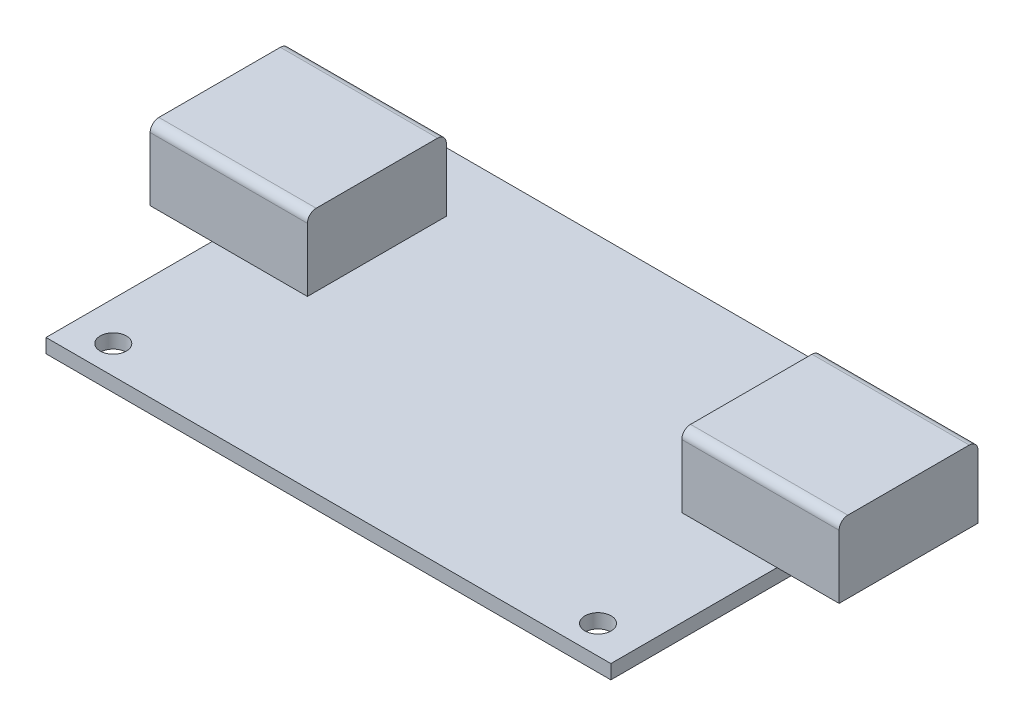
ISO-10303-21;
HEADER;
FILE_DESCRIPTION(('STEP AP214'),'2;1');
FILE_NAME('part.step','',(''),(''),'','','');
FILE_SCHEMA(('AUTOMOTIVE_DESIGN { 1 0 10303 214 1 1 1 1 }'));
ENDSEC;
DATA;
#1=APPLICATION_CONTEXT('core data for automotive mechanical design processes');
#2=APPLICATION_PROTOCOL_DEFINITION('international standard','automotive_design',2000,#1);
#3=PRODUCT_CONTEXT('',#1,'mechanical');
#4=PRODUCT('Part','Part','',(#3));
#5=PRODUCT_RELATED_PRODUCT_CATEGORY('part','',(#4));
#6=PRODUCT_DEFINITION_FORMATION('','',#4);
#7=PRODUCT_DEFINITION_CONTEXT('part definition',#1,'design');
#8=PRODUCT_DEFINITION('design','',#6,#7);
#9=PRODUCT_DEFINITION_SHAPE('','',#8);
#10=(LENGTH_UNIT() NAMED_UNIT(*) SI_UNIT(.MILLI.,.METRE.));
#11=(NAMED_UNIT(*) PLANE_ANGLE_UNIT() SI_UNIT($,.RADIAN.));
#12=(NAMED_UNIT(*) SI_UNIT($,.STERADIAN.) SOLID_ANGLE_UNIT());
#13=UNCERTAINTY_MEASURE_WITH_UNIT(LENGTH_MEASURE(1.E-05),#10,'distance_accuracy_value','');
#14=(GEOMETRIC_REPRESENTATION_CONTEXT(3) GLOBAL_UNCERTAINTY_ASSIGNED_CONTEXT((#13)) GLOBAL_UNIT_ASSIGNED_CONTEXT((#10,
#11,#12)) REPRESENTATION_CONTEXT('',''));
#15=CARTESIAN_POINT('',(0.,0.,0.));
#16=DIRECTION('',(0.,0.,1.));
#17=DIRECTION('',(1.,0.,0.));
#18=AXIS2_PLACEMENT_3D('',#15,#16,#17);
#19=CARTESIAN_POINT('',(0.,1.62,0.));
#20=DIRECTION('',(0.,-1.,0.));
#21=DIRECTION('',(0.,0.,-1.));
#22=AXIS2_PLACEMENT_3D('',#19,#20,#21);
#23=PLANE('',#22);
#24=CARTESIAN_POINT('',(-29.325,1.62,-17.01));
#25=DIRECTION('',(0.,1.,0.));
#26=DIRECTION('',(0.,0.,1.));
#27=AXIS2_PLACEMENT_3D('',#24,#25,#26);
#28=CIRCLE('',#27,1.5);
#29=CARTESIAN_POINT('',(-29.325,1.62,-15.51));
#30=VERTEX_POINT('',#29);
#31=EDGE_CURVE('E231',#30,#30,#28,.T.);
#32=ORIENTED_EDGE('',*,*,#31,.F.);
#33=EDGE_LOOP('',(#32));
#34=FACE_BOUND('',#33,.T.);
#35=CARTESIAN_POINT('',(28.875,1.62,-17.01));
#36=DIRECTION('',(0.,1.,0.));
#37=DIRECTION('',(0.,0.,1.));
#38=AXIS2_PLACEMENT_3D('',#35,#36,#37);
#39=CIRCLE('',#38,1.5);
#40=CARTESIAN_POINT('',(28.875,1.62,-15.51));
#41=VERTEX_POINT('',#40);
#42=EDGE_CURVE('E237',#41,#41,#39,.T.);
#43=ORIENTED_EDGE('',*,*,#42,.F.);
#44=EDGE_LOOP('',(#43));
#45=FACE_BOUND('',#44,.T.);
#46=CARTESIAN_POINT('',(-27.875,1.62,17.61));
#47=DIRECTION('',(0.,1.,0.));
#48=DIRECTION('',(0.,0.,1.));
#49=AXIS2_PLACEMENT_3D('',#46,#47,#48);
#50=CIRCLE('',#49,1.5);
#51=CARTESIAN_POINT('',(-27.875,1.62,19.11));
#52=VERTEX_POINT('',#51);
#53=EDGE_CURVE('E243',#52,#52,#50,.T.);
#54=ORIENTED_EDGE('',*,*,#53,.F.);
#55=EDGE_LOOP('',(#54));
#56=FACE_BOUND('',#55,.T.);
#57=CARTESIAN_POINT('',(27.605,1.62,17.61));
#58=DIRECTION('',(0.,1.,0.));
#59=DIRECTION('',(0.,0.,1.));
#60=AXIS2_PLACEMENT_3D('',#57,#58,#59);
#61=CIRCLE('',#60,1.5);
#62=CARTESIAN_POINT('',(27.605,1.62,19.11));
#63=VERTEX_POINT('',#62);
#64=EDGE_CURVE('E249',#63,#63,#61,.T.);
#65=ORIENTED_EDGE('',*,*,#64,.F.);
#66=EDGE_LOOP('',(#65));
#67=FACE_BOUND('',#66,.T.);
#68=DIRECTION('',(0.,0.,-1.));
#69=VECTOR('',#68,1.);
#70=CARTESIAN_POINT('',(32.325,1.62,20.86));
#71=LINE('',#70,#69);
#72=CARTESIAN_POINT('',(32.325,1.62,20.86));
#73=VERTEX_POINT('',#72);
#74=CARTESIAN_POINT('',(32.325,1.62,1.84));
#75=VERTEX_POINT('',#74);
#76=EDGE_CURVE('E255',#73,#75,#71,.T.);
#77=ORIENTED_EDGE('',*,*,#76,.T.);
#78=DIRECTION('',(-1.,0.,0.));
#79=VECTOR('',#78,1.);
#80=CARTESIAN_POINT('',(39.425,1.62,1.84));
#81=LINE('',#80,#79);
#82=CARTESIAN_POINT('',(21.425,1.62,1.84));
#83=VERTEX_POINT('',#82);
#84=EDGE_CURVE('E182',#75,#83,#81,.T.);
#85=ORIENTED_EDGE('',*,*,#84,.T.);
#86=DIRECTION('',(0.,0.,-1.));
#87=VECTOR('',#86,1.);
#88=CARTESIAN_POINT('',(21.425,1.62,1.84));
#89=LINE('',#88,#87);
#90=CARTESIAN_POINT('',(21.425,1.62,-14.06));
#91=VERTEX_POINT('',#90);
#92=EDGE_CURVE('E330',#83,#91,#89,.T.);
#93=ORIENTED_EDGE('',*,*,#92,.T.);
#94=DIRECTION('',(1.,0.,0.));
#95=VECTOR('',#94,1.);
#96=CARTESIAN_POINT('',(39.425,1.62,-14.06));
#97=LINE('',#96,#95);
#98=CARTESIAN_POINT('',(32.325,1.62,-14.06));
#99=VERTEX_POINT('',#98);
#100=EDGE_CURVE('E191',#91,#99,#97,.T.);
#101=ORIENTED_EDGE('',*,*,#100,.T.);
#102=CARTESIAN_POINT('',(32.325,1.62,-20.86));
#103=VERTEX_POINT('',#102);
#104=EDGE_CURVE('E260',#99,#103,#71,.T.);
#105=ORIENTED_EDGE('',*,*,#104,.T.);
#106=DIRECTION('',(-1.,0.,0.));
#107=VECTOR('',#106,1.);
#108=CARTESIAN_POINT('',(-32.325,1.62,-20.86));
#109=LINE('',#108,#107);
#110=CARTESIAN_POINT('',(-32.325,1.62,-20.86));
#111=VERTEX_POINT('',#110);
#112=EDGE_CURVE('E258',#103,#111,#109,.T.);
#113=ORIENTED_EDGE('',*,*,#112,.T.);
#114=DIRECTION('',(0.,0.,1.));
#115=VECTOR('',#114,1.);
#116=CARTESIAN_POINT('',(-32.325,1.62,20.86));
#117=LINE('',#116,#115);
#118=CARTESIAN_POINT('',(-32.325,1.62,-14.06));
#119=VERTEX_POINT('',#118);
#120=EDGE_CURVE('E263',#111,#119,#117,.T.);
#121=ORIENTED_EDGE('',*,*,#120,.T.);
#122=DIRECTION('',(-1.,0.,0.));
#123=VECTOR('',#122,1.);
#124=CARTESIAN_POINT('',(-39.425,1.62,-14.06));
#125=LINE('',#124,#123);
#126=CARTESIAN_POINT('',(-21.425,1.62,-14.06));
#127=VERTEX_POINT('',#126);
#128=EDGE_CURVE('E214',#127,#119,#125,.T.);
#129=ORIENTED_EDGE('',*,*,#128,.F.);
#130=DIRECTION('',(0.,0.,-1.));
#131=VECTOR('',#130,1.);
#132=CARTESIAN_POINT('',(-21.425,1.62,1.84));
#133=LINE('',#132,#131);
#134=CARTESIAN_POINT('',(-21.425,1.62,1.84));
#135=VERTEX_POINT('',#134);
#136=EDGE_CURVE('E202',#135,#127,#133,.T.);
#137=ORIENTED_EDGE('',*,*,#136,.F.);
#138=DIRECTION('',(1.,0.,0.));
#139=VECTOR('',#138,1.);
#140=CARTESIAN_POINT('',(-39.425,1.62,1.84));
#141=LINE('',#140,#139);
#142=CARTESIAN_POINT('',(-32.325,1.62,1.84));
#143=VERTEX_POINT('',#142);
#144=EDGE_CURVE('E222',#143,#135,#141,.T.);
#145=ORIENTED_EDGE('',*,*,#144,.F.);
#146=CARTESIAN_POINT('',(-32.325,1.62,20.86));
#147=VERTEX_POINT('',#146);
#148=EDGE_CURVE('E262',#143,#147,#117,.T.);
#149=ORIENTED_EDGE('',*,*,#148,.T.);
#150=DIRECTION('',(1.,0.,0.));
#151=VECTOR('',#150,1.);
#152=CARTESIAN_POINT('',(-32.325,1.62,20.86));
#153=LINE('',#152,#151);
#154=EDGE_CURVE('E265',#147,#73,#153,.T.);
#155=ORIENTED_EDGE('',*,*,#154,.T.);
#156=EDGE_LOOP('',(#77,#85,#93,#101,#105,#113,#121,#129,#137,#145,#149,#155));
#157=FACE_BOUND('',#156,.T.);
#158=ADVANCED_FACE('F37',(#34,#45,#56,#67,#157),#23,.F.);
#159=CARTESIAN_POINT('',(0.,0.,0.));
#160=DIRECTION('',(0.,-1.,0.));
#161=DIRECTION('',(0.,0.,-1.));
#162=AXIS2_PLACEMENT_3D('',#159,#160,#161);
#163=PLANE('',#162);
#164=CARTESIAN_POINT('',(28.875,0.,-17.01));
#165=DIRECTION('',(0.,1.,0.));
#166=DIRECTION('',(0.,0.,1.));
#167=AXIS2_PLACEMENT_3D('',#164,#165,#166);
#168=CIRCLE('',#167,1.5);
#169=CARTESIAN_POINT('',(28.875,0.,-15.51));
#170=VERTEX_POINT('',#169);
#171=EDGE_CURVE('E234',#170,#170,#168,.T.);
#172=ORIENTED_EDGE('',*,*,#171,.T.);
#173=EDGE_LOOP('',(#172));
#174=FACE_BOUND('',#173,.T.);
#175=CARTESIAN_POINT('',(27.605,0.,17.61));
#176=DIRECTION('',(0.,1.,0.));
#177=DIRECTION('',(0.,0.,1.));
#178=AXIS2_PLACEMENT_3D('',#175,#176,#177);
#179=CIRCLE('',#178,1.5);
#180=CARTESIAN_POINT('',(27.605,0.,19.11));
#181=VERTEX_POINT('',#180);
#182=EDGE_CURVE('E246',#181,#181,#179,.T.);
#183=ORIENTED_EDGE('',*,*,#182,.T.);
#184=EDGE_LOOP('',(#183));
#185=FACE_BOUND('',#184,.T.);
#186=DIRECTION('',(0.,0.,-1.));
#187=VECTOR('',#186,1.);
#188=CARTESIAN_POINT('',(32.325,0.,20.86));
#189=LINE('',#188,#187);
#190=CARTESIAN_POINT('',(32.325,0.,20.86));
#191=VERTEX_POINT('',#190);
#192=CARTESIAN_POINT('',(32.325,0.,-20.86));
#193=VERTEX_POINT('',#192);
#194=EDGE_CURVE('E252',#191,#193,#189,.T.);
#195=ORIENTED_EDGE('',*,*,#194,.F.);
#196=DIRECTION('',(1.,0.,0.));
#197=VECTOR('',#196,1.);
#198=CARTESIAN_POINT('',(-32.325,0.,20.86));
#199=LINE('',#198,#197);
#200=CARTESIAN_POINT('',(-32.325,0.,20.86));
#201=VERTEX_POINT('',#200);
#202=EDGE_CURVE('E275',#201,#191,#199,.T.);
#203=ORIENTED_EDGE('',*,*,#202,.F.);
#204=DIRECTION('',(0.,0.,1.));
#205=VECTOR('',#204,1.);
#206=CARTESIAN_POINT('',(-32.325,0.,20.86));
#207=LINE('',#206,#205);
#208=CARTESIAN_POINT('',(-32.325,0.,-20.86));
#209=VERTEX_POINT('',#208);
#210=EDGE_CURVE('E273',#209,#201,#207,.T.);
#211=ORIENTED_EDGE('',*,*,#210,.F.);
#212=DIRECTION('',(-1.,0.,0.));
#213=VECTOR('',#212,1.);
#214=CARTESIAN_POINT('',(-32.325,0.,-20.86));
#215=LINE('',#214,#213);
#216=EDGE_CURVE('E271',#193,#209,#215,.T.);
#217=ORIENTED_EDGE('',*,*,#216,.F.);
#218=EDGE_LOOP('',(#195,#203,#211,#217));
#219=FACE_BOUND('',#218,.T.);
#220=CARTESIAN_POINT('',(-27.875,0.,17.61));
#221=DIRECTION('',(0.,1.,0.));
#222=DIRECTION('',(0.,0.,1.));
#223=AXIS2_PLACEMENT_3D('',#220,#221,#222);
#224=CIRCLE('',#223,1.5);
#225=CARTESIAN_POINT('',(-27.875,0.,19.11));
#226=VERTEX_POINT('',#225);
#227=EDGE_CURVE('E240',#226,#226,#224,.T.);
#228=ORIENTED_EDGE('',*,*,#227,.T.);
#229=EDGE_LOOP('',(#228));
#230=FACE_BOUND('',#229,.T.);
#231=CARTESIAN_POINT('',(-29.325,0.,-17.01));
#232=DIRECTION('',(0.,1.,0.));
#233=DIRECTION('',(0.,0.,1.));
#234=AXIS2_PLACEMENT_3D('',#231,#232,#233);
#235=CIRCLE('',#234,1.5);
#236=CARTESIAN_POINT('',(-29.325,0.,-15.51));
#237=VERTEX_POINT('',#236);
#238=EDGE_CURVE('E230',#237,#237,#235,.T.);
#239=ORIENTED_EDGE('',*,*,#238,.T.);
#240=EDGE_LOOP('',(#239));
#241=FACE_BOUND('',#240,.T.);
#242=ADVANCED_FACE('F339',(#174,#185,#219,#230,#241),#163,.T.);
#243=CARTESIAN_POINT('',(32.325,1.62,20.86));
#244=DIRECTION('',(-1.,0.,0.));
#245=DIRECTION('',(0.,0.,1.));
#246=AXIS2_PLACEMENT_3D('',#243,#244,#245);
#247=PLANE('',#246);
#248=ORIENTED_EDGE('',*,*,#194,.T.);
#249=DIRECTION('',(0.,-1.,0.));
#250=VECTOR('',#249,1.);
#251=CARTESIAN_POINT('',(32.325,1.62,-20.86));
#252=LINE('',#251,#250);
#253=EDGE_CURVE('E285',#103,#193,#252,.T.);
#254=ORIENTED_EDGE('',*,*,#253,.F.);
#255=ORIENTED_EDGE('',*,*,#104,.F.);
#256=EDGE_CURVE('E259',#75,#99,#71,.T.);
#257=ORIENTED_EDGE('',*,*,#256,.F.);
#258=ORIENTED_EDGE('',*,*,#76,.F.);
#259=DIRECTION('',(0.,-1.,0.));
#260=VECTOR('',#259,1.);
#261=CARTESIAN_POINT('',(32.325,1.62,20.86));
#262=LINE('',#261,#260);
#263=EDGE_CURVE('E268',#73,#191,#262,.T.);
#264=ORIENTED_EDGE('',*,*,#263,.T.);
#265=EDGE_LOOP('',(#248,#254,#255,#257,#258,#264));
#266=FACE_BOUND('',#265,.T.);
#267=ADVANCED_FACE('F345',(#266),#247,.F.);
#268=CARTESIAN_POINT('',(-32.325,1.62,-20.86));
#269=DIRECTION('',(0.,0.,1.));
#270=DIRECTION('',(1.,0.,0.));
#271=AXIS2_PLACEMENT_3D('',#268,#269,#270);
#272=PLANE('',#271);
#273=ORIENTED_EDGE('',*,*,#216,.T.);
#274=DIRECTION('',(0.,-1.,0.));
#275=VECTOR('',#274,1.);
#276=CARTESIAN_POINT('',(-32.325,1.62,-20.86));
#277=LINE('',#276,#275);
#278=EDGE_CURVE('E282',#111,#209,#277,.T.);
#279=ORIENTED_EDGE('',*,*,#278,.F.);
#280=ORIENTED_EDGE('',*,*,#112,.F.);
#281=ORIENTED_EDGE('',*,*,#253,.T.);
#282=EDGE_LOOP('',(#273,#279,#280,#281));
#283=FACE_BOUND('',#282,.T.);
#284=ADVANCED_FACE('F361',(#283),#272,.F.);
#285=CARTESIAN_POINT('',(-32.325,1.62,20.86));
#286=DIRECTION('',(1.,0.,0.));
#287=DIRECTION('',(0.,0.,-1.));
#288=AXIS2_PLACEMENT_3D('',#285,#286,#287);
#289=PLANE('',#288);
#290=ORIENTED_EDGE('',*,*,#210,.T.);
#291=DIRECTION('',(0.,-1.,0.));
#292=VECTOR('',#291,1.);
#293=CARTESIAN_POINT('',(-32.325,1.62,20.86));
#294=LINE('',#293,#292);
#295=EDGE_CURVE('E279',#147,#201,#294,.T.);
#296=ORIENTED_EDGE('',*,*,#295,.F.);
#297=ORIENTED_EDGE('',*,*,#148,.F.);
#298=EDGE_CURVE('E266',#119,#143,#117,.T.);
#299=ORIENTED_EDGE('',*,*,#298,.F.);
#300=ORIENTED_EDGE('',*,*,#120,.F.);
#301=ORIENTED_EDGE('',*,*,#278,.T.);
#302=EDGE_LOOP('',(#290,#296,#297,#299,#300,#301));
#303=FACE_BOUND('',#302,.T.);
#304=ADVANCED_FACE('F357',(#303),#289,.F.);
#305=CARTESIAN_POINT('',(-32.325,1.62,20.86));
#306=DIRECTION('',(0.,0.,-1.));
#307=DIRECTION('',(-1.,0.,0.));
#308=AXIS2_PLACEMENT_3D('',#305,#306,#307);
#309=PLANE('',#308);
#310=ORIENTED_EDGE('',*,*,#202,.T.);
#311=ORIENTED_EDGE('',*,*,#263,.F.);
#312=ORIENTED_EDGE('',*,*,#154,.F.);
#313=ORIENTED_EDGE('',*,*,#295,.T.);
#314=EDGE_LOOP('',(#310,#311,#312,#313));
#315=FACE_BOUND('',#314,.T.);
#316=ADVANCED_FACE('F354',(#315),#309,.F.);
#317=CARTESIAN_POINT('',(27.605,1.62,17.61));
#318=DIRECTION('',(0.,-1.,0.));
#319=DIRECTION('',(0.,0.,-1.));
#320=AXIS2_PLACEMENT_3D('',#317,#318,#319);
#321=CYLINDRICAL_SURFACE('',#320,1.5);
#322=ORIENTED_EDGE('',*,*,#64,.T.);
#323=EDGE_LOOP('',(#322));
#324=FACE_BOUND('',#323,.T.);
#325=ORIENTED_EDGE('',*,*,#182,.F.);
#326=EDGE_LOOP('',(#325));
#327=FACE_BOUND('',#326,.T.);
#328=ADVANCED_FACE('F351',(#324,#327),#321,.F.);
#329=CARTESIAN_POINT('',(-27.875,1.62,17.61));
#330=DIRECTION('',(0.,-1.,0.));
#331=DIRECTION('',(0.,0.,-1.));
#332=AXIS2_PLACEMENT_3D('',#329,#330,#331);
#333=CYLINDRICAL_SURFACE('',#332,1.5);
#334=ORIENTED_EDGE('',*,*,#53,.T.);
#335=EDGE_LOOP('',(#334));
#336=FACE_BOUND('',#335,.T.);
#337=ORIENTED_EDGE('',*,*,#227,.F.);
#338=EDGE_LOOP('',(#337));
#339=FACE_BOUND('',#338,.T.);
#340=ADVANCED_FACE('F440',(#336,#339),#333,.F.);
#341=CARTESIAN_POINT('',(28.875,1.62,-17.01));
#342=DIRECTION('',(0.,-1.,0.));
#343=DIRECTION('',(0.,0.,-1.));
#344=AXIS2_PLACEMENT_3D('',#341,#342,#343);
#345=CYLINDRICAL_SURFACE('',#344,1.5);
#346=ORIENTED_EDGE('',*,*,#42,.T.);
#347=EDGE_LOOP('',(#346));
#348=FACE_BOUND('',#347,.T.);
#349=ORIENTED_EDGE('',*,*,#171,.F.);
#350=EDGE_LOOP('',(#349));
#351=FACE_BOUND('',#350,.T.);
#352=ADVANCED_FACE('F432',(#348,#351),#345,.F.);
#353=CARTESIAN_POINT('',(-29.325,1.62,-17.01));
#354=DIRECTION('',(0.,-1.,0.));
#355=DIRECTION('',(0.,0.,-1.));
#356=AXIS2_PLACEMENT_3D('',#353,#354,#355);
#357=CYLINDRICAL_SURFACE('',#356,1.5);
#358=ORIENTED_EDGE('',*,*,#31,.T.);
#359=EDGE_LOOP('',(#358));
#360=FACE_BOUND('',#359,.T.);
#361=ORIENTED_EDGE('',*,*,#238,.F.);
#362=EDGE_LOOP('',(#361));
#363=FACE_BOUND('',#362,.T.);
#364=ADVANCED_FACE('F430',(#360,#363),#357,.F.);
#365=CARTESIAN_POINT('',(-21.425,9.87,1.84));
#366=DIRECTION('',(-1.,0.,0.));
#367=DIRECTION('',(0.,0.,1.));
#368=AXIS2_PLACEMENT_3D('',#365,#366,#367);
#369=PLANE('',#368);
#370=DIRECTION('',(0.,-1.,0.));
#371=VECTOR('',#370,1.);
#372=CARTESIAN_POINT('',(-21.425,9.87,-14.06));
#373=LINE('',#372,#371);
#374=CARTESIAN_POINT('',(-21.425,8.87,-14.06));
#375=VERTEX_POINT('',#374);
#376=EDGE_CURVE('E228',#375,#127,#373,.T.);
#377=ORIENTED_EDGE('',*,*,#376,.F.);
#378=CARTESIAN_POINT('',(-21.425,8.87,-13.06));
#379=DIRECTION('',(-1.,0.,0.));
#380=DIRECTION('',(0.,0.,1.));
#381=AXIS2_PLACEMENT_3D('',#378,#379,#380);
#382=CIRCLE('',#381,1.);
#383=CARTESIAN_POINT('',(-21.425,9.87,-13.06));
#384=VERTEX_POINT('',#383);
#385=EDGE_CURVE('E302',#375,#384,#382,.F.);
#386=ORIENTED_EDGE('',*,*,#385,.T.);
#387=DIRECTION('',(0.,0.,-1.));
#388=VECTOR('',#387,1.);
#389=CARTESIAN_POINT('',(-21.425,9.87,1.84));
#390=LINE('',#389,#388);
#391=CARTESIAN_POINT('',(-21.425,9.87,0.839999999999998));
#392=VERTEX_POINT('',#391);
#393=EDGE_CURVE('E203',#392,#384,#390,.T.);
#394=ORIENTED_EDGE('',*,*,#393,.F.);
#395=CARTESIAN_POINT('',(-21.425,8.87,0.839999999999998));
#396=DIRECTION('',(-1.,0.,0.));
#397=DIRECTION('',(0.,0.,1.));
#398=AXIS2_PLACEMENT_3D('',#395,#396,#397);
#399=CIRCLE('',#398,1.);
#400=CARTESIAN_POINT('',(-21.425,8.87,1.84));
#401=VERTEX_POINT('',#400);
#402=EDGE_CURVE('E300',#392,#401,#399,.F.);
#403=ORIENTED_EDGE('',*,*,#402,.T.);
#404=DIRECTION('',(0.,-1.,0.));
#405=VECTOR('',#404,1.);
#406=CARTESIAN_POINT('',(-21.425,9.87,1.84));
#407=LINE('',#406,#405);
#408=EDGE_CURVE('E210',#401,#135,#407,.T.);
#409=ORIENTED_EDGE('',*,*,#408,.T.);
#410=ORIENTED_EDGE('',*,*,#136,.T.);
#411=EDGE_LOOP('',(#377,#386,#394,#403,#409,#410));
#412=FACE_BOUND('',#411,.T.);
#413=ADVANCED_FACE('F412',(#412),#369,.F.);
#414=CARTESIAN_POINT('',(-39.425,9.87,-14.06));
#415=DIRECTION('',(0.,0.,1.));
#416=DIRECTION('',(1.,0.,0.));
#417=AXIS2_PLACEMENT_3D('',#414,#415,#416);
#418=PLANE('',#417);
#419=DIRECTION('',(0.,-1.,0.));
#420=VECTOR('',#419,1.);
#421=CARTESIAN_POINT('',(-39.425,9.87,-14.06));
#422=LINE('',#421,#420);
#423=CARTESIAN_POINT('',(-39.425,8.87,-14.06));
#424=VERTEX_POINT('',#423);
#425=CARTESIAN_POINT('',(-39.425,1.62,-14.06));
#426=VERTEX_POINT('',#425);
#427=EDGE_CURVE('E226',#424,#426,#422,.T.);
#428=ORIENTED_EDGE('',*,*,#427,.F.);
#429=DIRECTION('',(-1.,0.,0.));
#430=VECTOR('',#429,1.);
#431=CARTESIAN_POINT('',(-39.425,8.87,-14.06));
#432=LINE('',#431,#430);
#433=EDGE_CURVE('E298',#424,#375,#432,.F.);
#434=ORIENTED_EDGE('',*,*,#433,.T.);
#435=ORIENTED_EDGE('',*,*,#376,.T.);
#436=ORIENTED_EDGE('',*,*,#128,.T.);
#437=EDGE_CURVE('E213',#119,#426,#125,.T.);
#438=ORIENTED_EDGE('',*,*,#437,.T.);
#439=EDGE_LOOP('',(#428,#434,#435,#436,#438));
#440=FACE_BOUND('',#439,.T.);
#441=ADVANCED_FACE('F397',(#440),#418,.F.);
#442=CARTESIAN_POINT('',(-39.425,9.87,1.84));
#443=DIRECTION('',(1.,0.,0.));
#444=DIRECTION('',(0.,0.,-1.));
#445=AXIS2_PLACEMENT_3D('',#442,#443,#444);
#446=PLANE('',#445);
#447=DIRECTION('',(0.,0.,1.));
#448=VECTOR('',#447,1.);
#449=CARTESIAN_POINT('',(-39.425,9.87,1.84));
#450=LINE('',#449,#448);
#451=CARTESIAN_POINT('',(-39.425,9.87,-13.06));
#452=VERTEX_POINT('',#451);
#453=CARTESIAN_POINT('',(-39.425,9.87,0.839999999999998));
#454=VERTEX_POINT('',#453);
#455=EDGE_CURVE('E206',#452,#454,#450,.T.);
#456=ORIENTED_EDGE('',*,*,#455,.F.);
#457=CARTESIAN_POINT('',(-39.425,8.87,-13.06));
#458=DIRECTION('',(1.,0.,0.));
#459=DIRECTION('',(0.,0.,-1.));
#460=AXIS2_PLACEMENT_3D('',#457,#458,#459);
#461=CIRCLE('',#460,1.);
#462=EDGE_CURVE('E296',#452,#424,#461,.F.);
#463=ORIENTED_EDGE('',*,*,#462,.T.);
#464=ORIENTED_EDGE('',*,*,#427,.T.);
#465=DIRECTION('',(0.,0.,1.));
#466=VECTOR('',#465,1.);
#467=CARTESIAN_POINT('',(-39.425,1.62,1.84));
#468=LINE('',#467,#466);
#469=CARTESIAN_POINT('',(-39.425,1.62,1.84));
#470=VERTEX_POINT('',#469);
#471=EDGE_CURVE('E217',#426,#470,#468,.T.);
#472=ORIENTED_EDGE('',*,*,#471,.T.);
#473=DIRECTION('',(0.,-1.,0.));
#474=VECTOR('',#473,1.);
#475=CARTESIAN_POINT('',(-39.425,9.87,1.84));
#476=LINE('',#475,#474);
#477=CARTESIAN_POINT('',(-39.425,8.87,1.84));
#478=VERTEX_POINT('',#477);
#479=EDGE_CURVE('E224',#478,#470,#476,.T.);
#480=ORIENTED_EDGE('',*,*,#479,.F.);
#481=CARTESIAN_POINT('',(-39.425,8.87,0.839999999999998));
#482=DIRECTION('',(1.,0.,0.));
#483=DIRECTION('',(0.,0.,-1.));
#484=AXIS2_PLACEMENT_3D('',#481,#482,#483);
#485=CIRCLE('',#484,1.);
#486=EDGE_CURVE('E294',#478,#454,#485,.F.);
#487=ORIENTED_EDGE('',*,*,#486,.T.);
#488=EDGE_LOOP('',(#456,#463,#464,#472,#480,#487));
#489=FACE_BOUND('',#488,.T.);
#490=ADVANCED_FACE('F387',(#489),#446,.F.);
#491=CARTESIAN_POINT('',(-39.425,9.87,1.84));
#492=DIRECTION('',(0.,0.,-1.));
#493=DIRECTION('',(-1.,0.,0.));
#494=AXIS2_PLACEMENT_3D('',#491,#492,#493);
#495=PLANE('',#494);
#496=ORIENTED_EDGE('',*,*,#408,.F.);
#497=DIRECTION('',(1.,0.,0.));
#498=VECTOR('',#497,1.);
#499=CARTESIAN_POINT('',(-39.425,8.87,1.84));
#500=LINE('',#499,#498);
#501=EDGE_CURVE('E304',#401,#478,#500,.F.);
#502=ORIENTED_EDGE('',*,*,#501,.T.);
#503=ORIENTED_EDGE('',*,*,#479,.T.);
#504=EDGE_CURVE('E207',#470,#143,#141,.T.);
#505=ORIENTED_EDGE('',*,*,#504,.T.);
#506=ORIENTED_EDGE('',*,*,#144,.T.);
#507=EDGE_LOOP('',(#496,#502,#503,#505,#506));
#508=FACE_BOUND('',#507,.T.);
#509=ADVANCED_FACE('F409',(#508),#495,.F.);
#510=CARTESIAN_POINT('',(0.,9.87,0.));
#511=DIRECTION('',(0.,-1.,0.));
#512=DIRECTION('',(0.,0.,-1.));
#513=AXIS2_PLACEMENT_3D('',#510,#511,#512);
#514=PLANE('',#513);
#515=ORIENTED_EDGE('',*,*,#393,.T.);
#516=DIRECTION('',(-1.,0.,0.));
#517=VECTOR('',#516,1.);
#518=CARTESIAN_POINT('',(0.,9.87,-13.06));
#519=LINE('',#518,#517);
#520=EDGE_CURVE('E291',#384,#452,#519,.T.);
#521=ORIENTED_EDGE('',*,*,#520,.T.);
#522=ORIENTED_EDGE('',*,*,#455,.T.);
#523=DIRECTION('',(1.,0.,0.));
#524=VECTOR('',#523,1.);
#525=CARTESIAN_POINT('',(0.,9.87,0.839999999999998));
#526=LINE('',#525,#524);
#527=EDGE_CURVE('E288',#454,#392,#526,.T.);
#528=ORIENTED_EDGE('',*,*,#527,.T.);
#529=EDGE_LOOP('',(#515,#521,#522,#528));
#530=FACE_BOUND('',#529,.T.);
#531=ADVANCED_FACE('F389',(#530),#514,.F.);
#532=CARTESIAN_POINT('',(0.,1.62,0.));
#533=DIRECTION('',(0.,-1.,0.));
#534=DIRECTION('',(0.,0.,-1.));
#535=AXIS2_PLACEMENT_3D('',#532,#533,#534);
#536=PLANE('',#535);
#537=ORIENTED_EDGE('',*,*,#437,.F.);
#538=ORIENTED_EDGE('',*,*,#298,.T.);
#539=ORIENTED_EDGE('',*,*,#504,.F.);
#540=ORIENTED_EDGE('',*,*,#471,.F.);
#541=EDGE_LOOP('',(#537,#538,#539,#540));
#542=FACE_BOUND('',#541,.T.);
#543=ADVANCED_FACE('F373',(#542),#536,.T.);
#544=CARTESIAN_POINT('',(0.,8.87,-13.06));
#545=DIRECTION('',(-1.,0.,0.));
#546=DIRECTION('',(0.,0.,1.));
#547=AXIS2_PLACEMENT_3D('',#544,#545,#546);
#548=CYLINDRICAL_SURFACE('',#547,1.);
#549=ORIENTED_EDGE('',*,*,#385,.F.);
#550=ORIENTED_EDGE('',*,*,#433,.F.);
#551=ORIENTED_EDGE('',*,*,#462,.F.);
#552=ORIENTED_EDGE('',*,*,#520,.F.);
#553=EDGE_LOOP('',(#549,#550,#551,#552));
#554=FACE_BOUND('',#553,.T.);
#555=ADVANCED_FACE('F369',(#554),#548,.T.);
#556=CARTESIAN_POINT('',(0.,8.87,0.839999999999998));
#557=DIRECTION('',(1.,0.,0.));
#558=DIRECTION('',(0.,0.,-1.));
#559=AXIS2_PLACEMENT_3D('',#556,#557,#558);
#560=CYLINDRICAL_SURFACE('',#559,1.);
#561=ORIENTED_EDGE('',*,*,#486,.F.);
#562=ORIENTED_EDGE('',*,*,#501,.F.);
#563=ORIENTED_EDGE('',*,*,#402,.F.);
#564=ORIENTED_EDGE('',*,*,#527,.F.);
#565=EDGE_LOOP('',(#561,#562,#563,#564));
#566=FACE_BOUND('',#565,.T.);
#567=ADVANCED_FACE('F372',(#566),#560,.T.);
#568=CARTESIAN_POINT('',(0.,1.62,0.));
#569=DIRECTION('',(0.,-1.,0.));
#570=DIRECTION('',(0.,0.,-1.));
#571=AXIS2_PLACEMENT_3D('',#568,#569,#570);
#572=PLANE('',#571);
#573=ORIENTED_EDGE('',*,*,#256,.T.);
#574=CARTESIAN_POINT('',(39.425,1.62,-14.06));
#575=VERTEX_POINT('',#574);
#576=EDGE_CURVE('E189',#99,#575,#97,.T.);
#577=ORIENTED_EDGE('',*,*,#576,.T.);
#578=DIRECTION('',(0.,0.,1.));
#579=VECTOR('',#578,1.);
#580=CARTESIAN_POINT('',(39.425,1.62,1.84));
#581=LINE('',#580,#579);
#582=CARTESIAN_POINT('',(39.425,1.62,1.84));
#583=VERTEX_POINT('',#582);
#584=EDGE_CURVE('E169',#575,#583,#581,.T.);
#585=ORIENTED_EDGE('',*,*,#584,.T.);
#586=EDGE_CURVE('E179',#583,#75,#81,.T.);
#587=ORIENTED_EDGE('',*,*,#586,.T.);
#588=EDGE_LOOP('',(#573,#577,#585,#587));
#589=FACE_BOUND('',#588,.T.);
#590=ADVANCED_FACE('F187',(#589),#572,.T.);
#591=CARTESIAN_POINT('',(21.425,9.87,1.84));
#592=DIRECTION('',(-1.,0.,0.));
#593=DIRECTION('',(0.,0.,1.));
#594=AXIS2_PLACEMENT_3D('',#591,#592,#593);
#595=PLANE('',#594);
#596=DIRECTION('',(0.,0.,-1.));
#597=VECTOR('',#596,1.);
#598=CARTESIAN_POINT('',(21.425,9.87,1.84));
#599=LINE('',#598,#597);
#600=CARTESIAN_POINT('',(21.425,9.87,0.839999999999998));
#601=VERTEX_POINT('',#600);
#602=CARTESIAN_POINT('',(21.425,9.87,-13.06));
#603=VERTEX_POINT('',#602);
#604=EDGE_CURVE('E196',#601,#603,#599,.T.);
#605=ORIENTED_EDGE('',*,*,#604,.T.);
#606=CARTESIAN_POINT('',(21.425,8.87,-13.06));
#607=DIRECTION('',(-1.,0.,0.));
#608=DIRECTION('',(0.,0.,1.));
#609=AXIS2_PLACEMENT_3D('',#606,#607,#608);
#610=CIRCLE('',#609,1.);
#611=CARTESIAN_POINT('',(21.425,8.87,-14.06));
#612=VERTEX_POINT('',#611);
#613=EDGE_CURVE('E45',#603,#612,#610,.T.);
#614=ORIENTED_EDGE('',*,*,#613,.T.);
#615=DIRECTION('',(0.,-1.,0.));
#616=VECTOR('',#615,1.);
#617=CARTESIAN_POINT('',(21.425,9.87,-14.06));
#618=LINE('',#617,#616);
#619=EDGE_CURVE('E197',#612,#91,#618,.T.);
#620=ORIENTED_EDGE('',*,*,#619,.T.);
#621=ORIENTED_EDGE('',*,*,#92,.F.);
#622=DIRECTION('',(0.,-1.,0.));
#623=VECTOR('',#622,1.);
#624=CARTESIAN_POINT('',(21.425,9.87,1.84));
#625=LINE('',#624,#623);
#626=CARTESIAN_POINT('',(21.425,8.87,1.84));
#627=VERTEX_POINT('',#626);
#628=EDGE_CURVE('E174',#627,#83,#625,.T.);
#629=ORIENTED_EDGE('',*,*,#628,.F.);
#630=CARTESIAN_POINT('',(21.425,8.87,0.839999999999998));
#631=DIRECTION('',(-1.,0.,0.));
#632=DIRECTION('',(0.,0.,1.));
#633=AXIS2_PLACEMENT_3D('',#630,#631,#632);
#634=CIRCLE('',#633,1.);
#635=EDGE_CURVE('E52',#627,#601,#634,.T.);
#636=ORIENTED_EDGE('',*,*,#635,.T.);
#637=EDGE_LOOP('',(#605,#614,#620,#621,#629,#636));
#638=FACE_BOUND('',#637,.T.);
#639=ADVANCED_FACE('F318',(#638),#595,.T.);
#640=CARTESIAN_POINT('',(39.425,9.87,1.84));
#641=DIRECTION('',(0.,0.,1.));
#642=DIRECTION('',(1.,0.,0.));
#643=AXIS2_PLACEMENT_3D('',#640,#641,#642);
#644=PLANE('',#643);
#645=DIRECTION('',(0.,-1.,0.));
#646=VECTOR('',#645,1.);
#647=CARTESIAN_POINT('',(39.425,9.87,1.84));
#648=LINE('',#647,#646);
#649=CARTESIAN_POINT('',(39.425,8.87,1.84));
#650=VERTEX_POINT('',#649);
#651=EDGE_CURVE('E164',#650,#583,#648,.T.);
#652=ORIENTED_EDGE('',*,*,#651,.F.);
#653=DIRECTION('',(-1.,0.,0.));
#654=VECTOR('',#653,1.);
#655=CARTESIAN_POINT('',(21.425,8.87,1.84));
#656=LINE('',#655,#654);
#657=EDGE_CURVE('E11',#650,#627,#656,.T.);
#658=ORIENTED_EDGE('',*,*,#657,.T.);
#659=ORIENTED_EDGE('',*,*,#628,.T.);
#660=ORIENTED_EDGE('',*,*,#84,.F.);
#661=ORIENTED_EDGE('',*,*,#586,.F.);
#662=EDGE_LOOP('',(#652,#658,#659,#660,#661));
#663=FACE_BOUND('',#662,.T.);
#664=ADVANCED_FACE('F180',(#663),#644,.T.);
#665=CARTESIAN_POINT('',(39.425,9.87,1.84));
#666=DIRECTION('',(1.,0.,0.));
#667=DIRECTION('',(0.,0.,-1.));
#668=AXIS2_PLACEMENT_3D('',#665,#666,#667);
#669=PLANE('',#668);
#670=DIRECTION('',(0.,-1.,0.));
#671=VECTOR('',#670,1.);
#672=CARTESIAN_POINT('',(39.425,9.87,-14.06));
#673=LINE('',#672,#671);
#674=CARTESIAN_POINT('',(39.425,8.87,-14.06));
#675=VERTEX_POINT('',#674);
#676=EDGE_CURVE('E175',#675,#575,#673,.T.);
#677=ORIENTED_EDGE('',*,*,#676,.F.);
#678=CARTESIAN_POINT('',(39.425,8.87,-13.06));
#679=DIRECTION('',(1.,0.,0.));
#680=DIRECTION('',(0.,0.,-1.));
#681=AXIS2_PLACEMENT_3D('',#678,#679,#680);
#682=CIRCLE('',#681,1.);
#683=CARTESIAN_POINT('',(39.425,9.87,-13.06));
#684=VERTEX_POINT('',#683);
#685=EDGE_CURVE('E310',#675,#684,#682,.T.);
#686=ORIENTED_EDGE('',*,*,#685,.T.);
#687=DIRECTION('',(0.,0.,1.));
#688=VECTOR('',#687,1.);
#689=CARTESIAN_POINT('',(39.425,9.87,1.84));
#690=LINE('',#689,#688);
#691=CARTESIAN_POINT('',(39.425,9.87,0.839999999999998));
#692=VERTEX_POINT('',#691);
#693=EDGE_CURVE('E199',#684,#692,#690,.T.);
#694=ORIENTED_EDGE('',*,*,#693,.T.);
#695=CARTESIAN_POINT('',(39.425,8.87,0.839999999999998));
#696=DIRECTION('',(1.,0.,0.));
#697=DIRECTION('',(0.,0.,-1.));
#698=AXIS2_PLACEMENT_3D('',#695,#696,#697);
#699=CIRCLE('',#698,1.);
#700=EDGE_CURVE('E172',#692,#650,#699,.T.);
#701=ORIENTED_EDGE('',*,*,#700,.T.);
#702=ORIENTED_EDGE('',*,*,#651,.T.);
#703=ORIENTED_EDGE('',*,*,#584,.F.);
#704=EDGE_LOOP('',(#677,#686,#694,#701,#702,#703));
#705=FACE_BOUND('',#704,.T.);
#706=ADVANCED_FACE('F167',(#705),#669,.T.);
#707=CARTESIAN_POINT('',(39.425,9.87,-14.06));
#708=DIRECTION('',(0.,0.,-1.));
#709=DIRECTION('',(-1.,0.,0.));
#710=AXIS2_PLACEMENT_3D('',#707,#708,#709);
#711=PLANE('',#710);
#712=ORIENTED_EDGE('',*,*,#619,.F.);
#713=DIRECTION('',(1.,0.,0.));
#714=VECTOR('',#713,1.);
#715=CARTESIAN_POINT('',(39.425,8.87,-14.06));
#716=LINE('',#715,#714);
#717=EDGE_CURVE('E306',#612,#675,#716,.T.);
#718=ORIENTED_EDGE('',*,*,#717,.T.);
#719=ORIENTED_EDGE('',*,*,#676,.T.);
#720=ORIENTED_EDGE('',*,*,#576,.F.);
#721=ORIENTED_EDGE('',*,*,#100,.F.);
#722=EDGE_LOOP('',(#712,#718,#719,#720,#721));
#723=FACE_BOUND('',#722,.T.);
#724=ADVANCED_FACE('F325',(#723),#711,.T.);
#725=CARTESIAN_POINT('',(0.,9.87,0.));
#726=DIRECTION('',(0.,-1.,0.));
#727=DIRECTION('',(0.,0.,-1.));
#728=AXIS2_PLACEMENT_3D('',#725,#726,#727);
#729=PLANE('',#728);
#730=ORIENTED_EDGE('',*,*,#693,.F.);
#731=DIRECTION('',(1.,0.,0.));
#732=VECTOR('',#731,1.);
#733=CARTESIAN_POINT('',(21.425,9.87,-13.06));
#734=LINE('',#733,#732);
#735=EDGE_CURVE('E59',#684,#603,#734,.F.);
#736=ORIENTED_EDGE('',*,*,#735,.T.);
#737=ORIENTED_EDGE('',*,*,#604,.F.);
#738=DIRECTION('',(-1.,0.,0.));
#739=VECTOR('',#738,1.);
#740=CARTESIAN_POINT('',(39.425,9.87,0.839999999999998));
#741=LINE('',#740,#739);
#742=EDGE_CURVE('E312',#601,#692,#741,.F.);
#743=ORIENTED_EDGE('',*,*,#742,.T.);
#744=EDGE_LOOP('',(#730,#736,#737,#743));
#745=FACE_BOUND('',#744,.T.);
#746=ADVANCED_FACE('F327',(#745),#729,.F.);
#747=CARTESIAN_POINT('',(39.425,8.87,-13.06));
#748=DIRECTION('',(-1.,0.,0.));
#749=DIRECTION('',(0.,0.,1.));
#750=AXIS2_PLACEMENT_3D('',#747,#748,#749);
#751=CYLINDRICAL_SURFACE('',#750,1.);
#752=ORIENTED_EDGE('',*,*,#613,.F.);
#753=ORIENTED_EDGE('',*,*,#735,.F.);
#754=ORIENTED_EDGE('',*,*,#685,.F.);
#755=ORIENTED_EDGE('',*,*,#717,.F.);
#756=EDGE_LOOP('',(#752,#753,#754,#755));
#757=FACE_BOUND('',#756,.T.);
#758=ADVANCED_FACE('F326',(#757),#751,.T.);
#759=CARTESIAN_POINT('',(39.425,8.87,0.839999999999998));
#760=DIRECTION('',(1.,0.,0.));
#761=DIRECTION('',(0.,0.,-1.));
#762=AXIS2_PLACEMENT_3D('',#759,#760,#761);
#763=CYLINDRICAL_SURFACE('',#762,1.);
#764=ORIENTED_EDGE('',*,*,#700,.F.);
#765=ORIENTED_EDGE('',*,*,#742,.F.);
#766=ORIENTED_EDGE('',*,*,#635,.F.);
#767=ORIENTED_EDGE('',*,*,#657,.F.);
#768=EDGE_LOOP('',(#764,#765,#766,#767));
#769=FACE_BOUND('',#768,.T.);
#770=ADVANCED_FACE('F39',(#769),#763,.T.);
#771=CLOSED_SHELL('',(#158,#242,#267,#284,#304,#316,#328,#340,#352,#364,#413,#441,#490,#509,
#531,#543,#555,#567,#590,#639,#664,#706,#724,#746,#758,#770));
#772=MANIFOLD_SOLID_BREP('B2',#771);
#773=ADVANCED_BREP_SHAPE_REPRESENTATION('',(#18,#772),#14);
#774=SHAPE_DEFINITION_REPRESENTATION(#9,#773);
ENDSEC;
END-ISO-10303-21;
